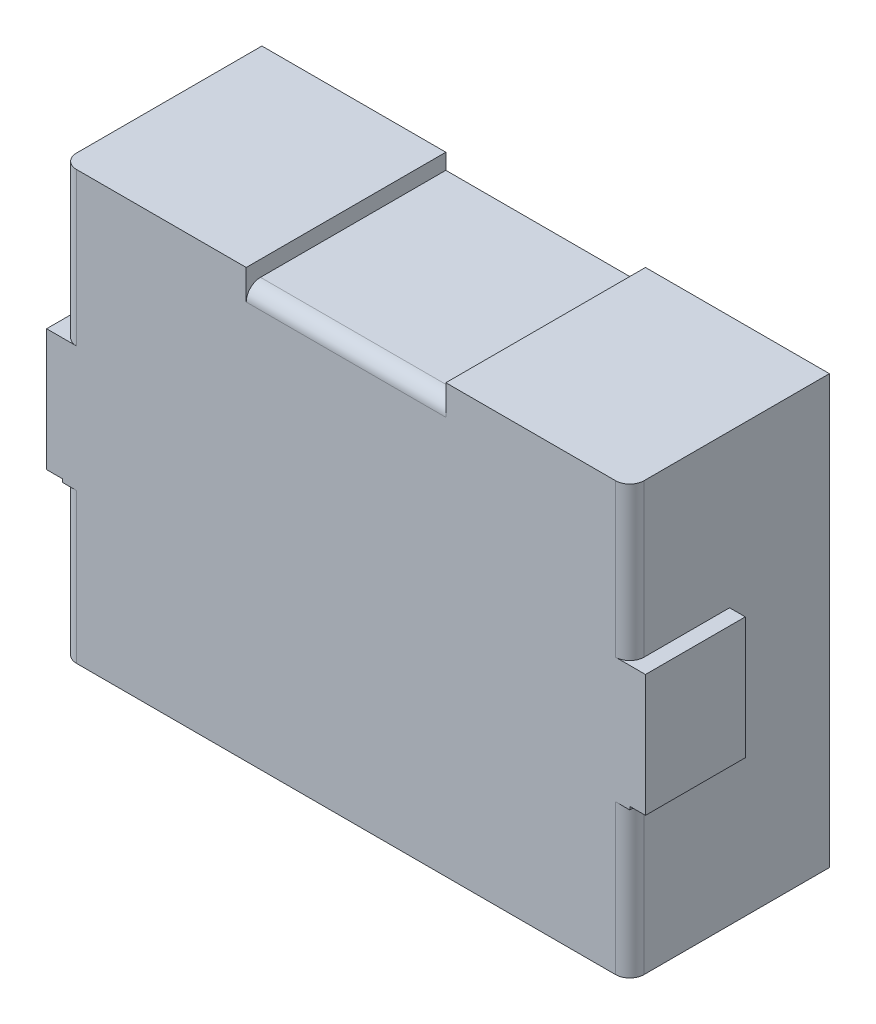
ISO-10303-21;
HEADER;
FILE_DESCRIPTION(('STEP AP214'),'2;1');
FILE_NAME('part.step','',(''),(''),'','','');
FILE_SCHEMA(('AUTOMOTIVE_DESIGN { 1 0 10303 214 1 1 1 1 }'));
ENDSEC;
DATA;
#1=APPLICATION_CONTEXT('core data for automotive mechanical design processes');
#2=APPLICATION_PROTOCOL_DEFINITION('international standard','automotive_design',2000,#1);
#3=PRODUCT_CONTEXT('',#1,'mechanical');
#4=PRODUCT('Part','Part','',(#3));
#5=PRODUCT_RELATED_PRODUCT_CATEGORY('part','',(#4));
#6=PRODUCT_DEFINITION_FORMATION('','',#4);
#7=PRODUCT_DEFINITION_CONTEXT('part definition',#1,'design');
#8=PRODUCT_DEFINITION('design','',#6,#7);
#9=PRODUCT_DEFINITION_SHAPE('','',#8);
#10=(LENGTH_UNIT() NAMED_UNIT(*) SI_UNIT(.MILLI.,.METRE.));
#11=(NAMED_UNIT(*) PLANE_ANGLE_UNIT() SI_UNIT($,.RADIAN.));
#12=(NAMED_UNIT(*) SI_UNIT($,.STERADIAN.) SOLID_ANGLE_UNIT());
#13=UNCERTAINTY_MEASURE_WITH_UNIT(LENGTH_MEASURE(1.E-05),#10,'distance_accuracy_value','');
#14=(GEOMETRIC_REPRESENTATION_CONTEXT(3) GLOBAL_UNCERTAINTY_ASSIGNED_CONTEXT((#13)) GLOBAL_UNIT_ASSIGNED_CONTEXT((#10,
#11,#12)) REPRESENTATION_CONTEXT('',''));
#15=CARTESIAN_POINT('',(0.,0.,0.));
#16=DIRECTION('',(0.,0.,1.));
#17=DIRECTION('',(1.,0.,0.));
#18=AXIS2_PLACEMENT_3D('',#15,#16,#17);
#19=CARTESIAN_POINT('',(2.1,0.,1.4));
#20=DIRECTION('',(1.,0.,0.));
#21=DIRECTION('',(0.,0.,-1.));
#22=AXIS2_PLACEMENT_3D('',#19,#20,#21);
#23=PLANE('',#22);
#24=DIRECTION('',(0.,1.,0.));
#25=VECTOR('',#24,1.);
#26=CARTESIAN_POINT('',(2.1,0.,0.7));
#27=LINE('',#26,#25);
#28=CARTESIAN_POINT('',(2.1,0.427884559631,0.7));
#29=VERTEX_POINT('',#28);
#30=CARTESIAN_POINT('',(2.1,-0.427884559631,0.7));
#31=VERTEX_POINT('',#30);
#32=EDGE_CURVE('E270',#29,#31,#27,.F.);
#33=ORIENTED_EDGE('',*,*,#32,.F.);
#34=DIRECTION('',(0.,0.,1.));
#35=VECTOR('',#34,1.);
#36=CARTESIAN_POINT('',(2.1,0.427884559631,1.05));
#37=LINE('',#36,#35);
#38=CARTESIAN_POINT('',(2.1,0.427884559631,1.4));
#39=VERTEX_POINT('',#38);
#40=EDGE_CURVE('E210',#39,#29,#37,.F.);
#41=ORIENTED_EDGE('',*,*,#40,.F.);
#42=DIRECTION('',(0.,1.,0.));
#43=VECTOR('',#42,1.);
#44=CARTESIAN_POINT('',(2.1,0.00558828281121,1.4));
#45=LINE('',#44,#43);
#46=CARTESIAN_POINT('',(2.1,-0.427884559631,1.4));
#47=VERTEX_POINT('',#46);
#48=EDGE_CURVE('E256',#47,#39,#45,.T.);
#49=ORIENTED_EDGE('',*,*,#48,.F.);
#50=DIRECTION('',(0.,0.,-1.));
#51=VECTOR('',#50,1.);
#52=CARTESIAN_POINT('',(2.1,-0.427884559631,1.05));
#53=LINE('',#52,#51);
#54=EDGE_CURVE('E282',#31,#47,#53,.F.);
#55=ORIENTED_EDGE('',*,*,#54,.F.);
#56=EDGE_LOOP('',(#33,#41,#49,#55));
#57=FACE_BOUND('',#56,.T.);
#58=ADVANCED_FACE('F17',(#57),#23,.T.);
#59=CARTESIAN_POINT('',(-2.1,0.,1.4));
#60=DIRECTION('',(1.,0.,0.));
#61=DIRECTION('',(0.,0.,-1.));
#62=AXIS2_PLACEMENT_3D('',#59,#60,#61);
#63=PLANE('',#62);
#64=DIRECTION('',(0.,1.,0.));
#65=VECTOR('',#64,1.);
#66=CARTESIAN_POINT('',(-2.1,0.00558828281121,1.4));
#67=LINE('',#66,#65);
#68=CARTESIAN_POINT('',(-2.1,0.427884559631,1.4));
#69=VERTEX_POINT('',#68);
#70=CARTESIAN_POINT('',(-2.1,-0.427884559631,1.4));
#71=VERTEX_POINT('',#70);
#72=EDGE_CURVE('E213',#69,#71,#67,.F.);
#73=ORIENTED_EDGE('',*,*,#72,.F.);
#74=DIRECTION('',(0.,0.,1.));
#75=VECTOR('',#74,1.);
#76=CARTESIAN_POINT('',(-2.1,0.427884559631,1.05));
#77=LINE('',#76,#75);
#78=CARTESIAN_POINT('',(-2.1,0.427884559631,0.7));
#79=VERTEX_POINT('',#78);
#80=EDGE_CURVE('E216',#79,#69,#77,.T.);
#81=ORIENTED_EDGE('',*,*,#80,.F.);
#82=DIRECTION('',(0.,1.,0.));
#83=VECTOR('',#82,1.);
#84=CARTESIAN_POINT('',(-2.1,0.,0.7));
#85=LINE('',#84,#83);
#86=CARTESIAN_POINT('',(-2.1,-0.427884559631,0.7));
#87=VERTEX_POINT('',#86);
#88=EDGE_CURVE('E219',#87,#79,#85,.T.);
#89=ORIENTED_EDGE('',*,*,#88,.F.);
#90=DIRECTION('',(0.,0.,-1.));
#91=VECTOR('',#90,1.);
#92=CARTESIAN_POINT('',(-2.1,-0.427884559631,1.05));
#93=LINE('',#92,#91);
#94=EDGE_CURVE('E227',#71,#87,#93,.T.);
#95=ORIENTED_EDGE('',*,*,#94,.F.);
#96=EDGE_LOOP('',(#73,#81,#89,#95));
#97=FACE_BOUND('',#96,.T.);
#98=ADVANCED_FACE('F475',(#97),#63,.F.);
#99=CARTESIAN_POINT('',(-8.062845587312,0.00558828281121,1.4));
#100=DIRECTION('',(0.,0.,1.));
#101=DIRECTION('',(1.,0.,0.));
#102=AXIS2_PLACEMENT_3D('',#99,#100,#101);
#103=PLANE('',#102);
#104=DIRECTION('',(0.,-1.,0.));
#105=VECTOR('',#104,1.);
#106=CARTESIAN_POINT('',(1.89,0.45,1.4));
#107=LINE('',#106,#105);
#108=CARTESIAN_POINT('',(1.89,1.5,1.4));
#109=VERTEX_POINT('',#108);
#110=CARTESIAN_POINT('',(1.89,0.427884559631,1.4));
#111=VERTEX_POINT('',#110);
#112=EDGE_CURVE('E321',#109,#111,#107,.T.);
#113=ORIENTED_EDGE('',*,*,#112,.F.);
#114=DIRECTION('',(1.,0.,0.));
#115=VECTOR('',#114,1.);
#116=CARTESIAN_POINT('',(-8.062845587312,1.5,1.4));
#117=LINE('',#116,#115);
#118=CARTESIAN_POINT('',(0.7,1.5,1.4));
#119=VERTEX_POINT('',#118);
#120=EDGE_CURVE('E202',#109,#119,#117,.F.);
#121=ORIENTED_EDGE('',*,*,#120,.T.);
#122=DIRECTION('',(0.,1.,0.));
#123=VECTOR('',#122,1.);
#124=CARTESIAN_POINT('',(0.7,1.5,1.4));
#125=LINE('',#124,#123);
#126=CARTESIAN_POINT('',(0.7,1.29,1.4));
#127=VERTEX_POINT('',#126);
#128=EDGE_CURVE('E254',#127,#119,#125,.T.);
#129=ORIENTED_EDGE('',*,*,#128,.F.);
#130=DIRECTION('',(1.,0.,0.));
#131=VECTOR('',#130,1.);
#132=CARTESIAN_POINT('',(0.49,1.29,1.4));
#133=LINE('',#132,#131);
#134=CARTESIAN_POINT('',(-0.7,1.29,1.4));
#135=VERTEX_POINT('',#134);
#136=EDGE_CURVE('E251',#135,#127,#133,.T.);
#137=ORIENTED_EDGE('',*,*,#136,.F.);
#138=DIRECTION('',(0.,1.,0.));
#139=VECTOR('',#138,1.);
#140=CARTESIAN_POINT('',(-0.7,1.5,1.4));
#141=LINE('',#140,#139);
#142=CARTESIAN_POINT('',(-0.7,1.5,1.4));
#143=VERTEX_POINT('',#142);
#144=EDGE_CURVE('E320',#135,#143,#141,.T.);
#145=ORIENTED_EDGE('',*,*,#144,.T.);
#146=DIRECTION('',(1.,0.,0.));
#147=VECTOR('',#146,1.);
#148=CARTESIAN_POINT('',(-8.062845587312,1.5,1.4));
#149=LINE('',#148,#147);
#150=CARTESIAN_POINT('',(-1.89,1.5,1.4));
#151=VERTEX_POINT('',#150);
#152=EDGE_CURVE('E238',#143,#151,#149,.F.);
#153=ORIENTED_EDGE('',*,*,#152,.T.);
#154=DIRECTION('',(0.,1.,0.));
#155=VECTOR('',#154,1.);
#156=CARTESIAN_POINT('',(-1.89,0.45,1.4));
#157=LINE('',#156,#155);
#158=CARTESIAN_POINT('',(-1.89,0.427884559631,1.4));
#159=VERTEX_POINT('',#158);
#160=EDGE_CURVE('E410',#159,#151,#157,.T.);
#161=ORIENTED_EDGE('',*,*,#160,.F.);
#162=DIRECTION('',(1.,0.,0.));
#163=VECTOR('',#162,1.);
#164=CARTESIAN_POINT('',(-2.1,0.427884559631,1.4));
#165=LINE('',#164,#163);
#166=EDGE_CURVE('E316',#69,#159,#165,.T.);
#167=ORIENTED_EDGE('',*,*,#166,.F.);
#168=ORIENTED_EDGE('',*,*,#72,.T.);
#169=DIRECTION('',(1.,0.,0.));
#170=VECTOR('',#169,1.);
#171=CARTESIAN_POINT('',(-2.1,-0.427884559631,1.4));
#172=LINE('',#171,#170);
#173=CARTESIAN_POINT('',(-1.99,-0.427884559631,1.4));
#174=VERTEX_POINT('',#173);
#175=EDGE_CURVE('E230',#174,#71,#172,.F.);
#176=ORIENTED_EDGE('',*,*,#175,.F.);
#177=DIRECTION('',(0.,1.,0.));
#178=VECTOR('',#177,1.);
#179=CARTESIAN_POINT('',(-1.99,0.00558828281121,1.4));
#180=LINE('',#179,#178);
#181=CARTESIAN_POINT('',(-1.99,-0.45,1.4));
#182=VERTEX_POINT('',#181);
#183=EDGE_CURVE('E211',#174,#182,#180,.F.);
#184=ORIENTED_EDGE('',*,*,#183,.T.);
#185=DIRECTION('',(1.,0.,0.));
#186=VECTOR('',#185,1.);
#187=CARTESIAN_POINT('',(-1.84,-0.45,1.4));
#188=LINE('',#187,#186);
#189=CARTESIAN_POINT('',(-1.89,-0.45,1.4));
#190=VERTEX_POINT('',#189);
#191=EDGE_CURVE('E208',#190,#182,#188,.F.);
#192=ORIENTED_EDGE('',*,*,#191,.F.);
#193=DIRECTION('',(0.,1.,0.));
#194=VECTOR('',#193,1.);
#195=CARTESIAN_POINT('',(-1.89,-1.5,1.4));
#196=LINE('',#195,#194);
#197=CARTESIAN_POINT('',(-1.89,-1.5,1.4));
#198=VERTEX_POINT('',#197);
#199=EDGE_CURVE('E205',#198,#190,#196,.T.);
#200=ORIENTED_EDGE('',*,*,#199,.F.);
#201=DIRECTION('',(1.,0.,0.));
#202=VECTOR('',#201,1.);
#203=CARTESIAN_POINT('',(0.,-1.5,1.4));
#204=LINE('',#203,#202);
#205=CARTESIAN_POINT('',(1.89,-1.5,1.4));
#206=VERTEX_POINT('',#205);
#207=EDGE_CURVE('E312',#206,#198,#204,.F.);
#208=ORIENTED_EDGE('',*,*,#207,.F.);
#209=DIRECTION('',(0.,-1.,0.));
#210=VECTOR('',#209,1.);
#211=CARTESIAN_POINT('',(1.89,-1.5,1.4));
#212=LINE('',#211,#210);
#213=CARTESIAN_POINT('',(1.89,-0.45,1.4));
#214=VERTEX_POINT('',#213);
#215=EDGE_CURVE('E184',#214,#206,#212,.T.);
#216=ORIENTED_EDGE('',*,*,#215,.F.);
#217=DIRECTION('',(1.,0.,0.));
#218=VECTOR('',#217,1.);
#219=CARTESIAN_POINT('',(1.84,-0.45,1.4));
#220=LINE('',#219,#218);
#221=CARTESIAN_POINT('',(1.99,-0.45,1.4));
#222=VERTEX_POINT('',#221);
#223=EDGE_CURVE('E181',#214,#222,#220,.T.);
#224=ORIENTED_EDGE('',*,*,#223,.T.);
#225=DIRECTION('',(0.,1.,0.));
#226=VECTOR('',#225,1.);
#227=CARTESIAN_POINT('',(1.99,0.00558828281121,1.4));
#228=LINE('',#227,#226);
#229=CARTESIAN_POINT('',(1.99,-0.427884559631,1.4));
#230=VERTEX_POINT('',#229);
#231=EDGE_CURVE('E173',#222,#230,#228,.T.);
#232=ORIENTED_EDGE('',*,*,#231,.T.);
#233=DIRECTION('',(1.,0.,0.));
#234=VECTOR('',#233,1.);
#235=CARTESIAN_POINT('',(2.1,-0.427884559631,1.4));
#236=LINE('',#235,#234);
#237=EDGE_CURVE('E284',#47,#230,#236,.F.);
#238=ORIENTED_EDGE('',*,*,#237,.F.);
#239=ORIENTED_EDGE('',*,*,#48,.T.);
#240=DIRECTION('',(1.,0.,0.));
#241=VECTOR('',#240,1.);
#242=CARTESIAN_POINT('',(2.1,0.427884559631,1.4));
#243=LINE('',#242,#241);
#244=EDGE_CURVE('E267',#111,#39,#243,.T.);
#245=ORIENTED_EDGE('',*,*,#244,.F.);
#246=EDGE_LOOP('',(#113,#121,#129,#137,#145,#153,#161,#167,#168,#176,#184,#192,#200,#208,#216,
#224,#232,#238,#239,#245));
#247=FACE_BOUND('',#246,.T.);
#248=ADVANCED_FACE('F364',(#247),#103,.T.);
#249=CARTESIAN_POINT('',(1.84,-0.45,1.4));
#250=DIRECTION('',(0.,1.,0.));
#251=DIRECTION('',(0.,0.,1.));
#252=AXIS2_PLACEMENT_3D('',#249,#250,#251);
#253=PLANE('',#252);
#254=CARTESIAN_POINT('',(1.89,-0.45,1.3));
#255=DIRECTION('',(0.,-1.,0.));
#256=DIRECTION('',(0.,0.,-1.));
#257=AXIS2_PLACEMENT_3D('',#254,#255,#256);
#258=CIRCLE('',#257,0.1);
#259=CARTESIAN_POINT('',(1.99,-0.45,1.3));
#260=VERTEX_POINT('',#259);
#261=EDGE_CURVE('E20',#260,#214,#258,.T.);
#262=ORIENTED_EDGE('',*,*,#261,.F.);
#263=DIRECTION('',(0.,0.,-1.));
#264=VECTOR('',#263,1.);
#265=CARTESIAN_POINT('',(1.99,-0.45,1.4));
#266=LINE('',#265,#264);
#267=EDGE_CURVE('E166',#222,#260,#266,.T.);
#268=ORIENTED_EDGE('',*,*,#267,.F.);
#269=ORIENTED_EDGE('',*,*,#223,.F.);
#270=EDGE_LOOP('',(#262,#268,#269));
#271=FACE_BOUND('',#270,.T.);
#272=ADVANCED_FACE('F180',(#271),#253,.F.);
#273=CARTESIAN_POINT('',(1.89,-1.5,1.3));
#274=DIRECTION('',(0.,-1.,0.));
#275=DIRECTION('',(0.,0.,-1.));
#276=AXIS2_PLACEMENT_3D('',#273,#274,#275);
#277=CYLINDRICAL_SURFACE('',#276,0.1);
#278=ORIENTED_EDGE('',*,*,#261,.T.);
#279=ORIENTED_EDGE('',*,*,#215,.T.);
#280=CARTESIAN_POINT('',(1.89,-1.5,1.3));
#281=DIRECTION('',(0.,-1.,0.));
#282=DIRECTION('',(0.,0.,-1.));
#283=AXIS2_PLACEMENT_3D('',#280,#281,#282);
#284=CIRCLE('',#283,0.1);
#285=CARTESIAN_POINT('',(1.99,-1.5,1.3));
#286=VERTEX_POINT('',#285);
#287=EDGE_CURVE('E187',#286,#206,#284,.T.);
#288=ORIENTED_EDGE('',*,*,#287,.F.);
#289=DIRECTION('',(0.,1.,0.));
#290=VECTOR('',#289,1.);
#291=CARTESIAN_POINT('',(1.99,0.,1.3));
#292=LINE('',#291,#290);
#293=EDGE_CURVE('E171',#260,#286,#292,.F.);
#294=ORIENTED_EDGE('',*,*,#293,.F.);
#295=EDGE_LOOP('',(#278,#279,#288,#294));
#296=FACE_BOUND('',#295,.T.);
#297=ADVANCED_FACE('F185',(#296),#277,.T.);
#298=CARTESIAN_POINT('',(2.1,0.427884559631,1.05));
#299=DIRECTION('',(0.,1.,0.));
#300=DIRECTION('',(0.,0.,1.));
#301=AXIS2_PLACEMENT_3D('',#298,#299,#300);
#302=PLANE('',#301);
#303=CARTESIAN_POINT('',(1.89,0.427884559631,1.3));
#304=DIRECTION('',(0.,-1.,0.));
#305=DIRECTION('',(0.,0.,-1.));
#306=AXIS2_PLACEMENT_3D('',#303,#304,#305);
#307=CIRCLE('',#306,0.1);
#308=CARTESIAN_POINT('',(1.99,0.427884559631,1.3));
#309=VERTEX_POINT('',#308);
#310=EDGE_CURVE('E289',#111,#309,#307,.F.);
#311=ORIENTED_EDGE('',*,*,#310,.F.);
#312=ORIENTED_EDGE('',*,*,#244,.T.);
#313=ORIENTED_EDGE('',*,*,#40,.T.);
#314=DIRECTION('',(-1.,0.,0.));
#315=VECTOR('',#314,1.);
#316=CARTESIAN_POINT('',(2.1,0.427884559631,0.7));
#317=LINE('',#316,#315);
#318=CARTESIAN_POINT('',(1.99,0.427884559631,0.7));
#319=VERTEX_POINT('',#318);
#320=EDGE_CURVE('E273',#319,#29,#317,.F.);
#321=ORIENTED_EDGE('',*,*,#320,.F.);
#322=DIRECTION('',(0.,0.,-1.));
#323=VECTOR('',#322,1.);
#324=CARTESIAN_POINT('',(1.99,0.427884559631,1.4));
#325=LINE('',#324,#323);
#326=EDGE_CURVE('E342',#309,#319,#325,.T.);
#327=ORIENTED_EDGE('',*,*,#326,.F.);
#328=EDGE_LOOP('',(#311,#312,#313,#321,#327));
#329=FACE_BOUND('',#328,.T.);
#330=ADVANCED_FACE('F471',(#329),#302,.T.);
#331=CARTESIAN_POINT('',(2.1,0.,0.7));
#332=DIRECTION('',(0.,0.,-1.));
#333=DIRECTION('',(-1.,0.,0.));
#334=AXIS2_PLACEMENT_3D('',#331,#332,#333);
#335=PLANE('',#334);
#336=ORIENTED_EDGE('',*,*,#32,.T.);
#337=DIRECTION('',(1.,0.,0.));
#338=VECTOR('',#337,1.);
#339=CARTESIAN_POINT('',(2.1,-0.427884559631,0.7));
#340=LINE('',#339,#338);
#341=CARTESIAN_POINT('',(1.99,-0.427884559631,0.7));
#342=VERTEX_POINT('',#341);
#343=EDGE_CURVE('E272',#342,#31,#340,.T.);
#344=ORIENTED_EDGE('',*,*,#343,.F.);
#345=DIRECTION('',(0.,1.,0.));
#346=VECTOR('',#345,1.);
#347=CARTESIAN_POINT('',(1.99,0.,0.7));
#348=LINE('',#347,#346);
#349=EDGE_CURVE('E293',#319,#342,#348,.F.);
#350=ORIENTED_EDGE('',*,*,#349,.F.);
#351=ORIENTED_EDGE('',*,*,#320,.T.);
#352=EDGE_LOOP('',(#336,#344,#350,#351));
#353=FACE_BOUND('',#352,.T.);
#354=ADVANCED_FACE('F356',(#353),#335,.T.);
#355=CARTESIAN_POINT('',(2.1,-0.427884559631,1.05));
#356=DIRECTION('',(0.,-1.,0.));
#357=DIRECTION('',(0.,0.,-1.));
#358=AXIS2_PLACEMENT_3D('',#355,#356,#357);
#359=PLANE('',#358);
#360=ORIENTED_EDGE('',*,*,#54,.T.);
#361=ORIENTED_EDGE('',*,*,#237,.T.);
#362=DIRECTION('',(0.,0.,-1.));
#363=VECTOR('',#362,1.);
#364=CARTESIAN_POINT('',(1.99,-0.427884559631,1.4));
#365=LINE('',#364,#363);
#366=EDGE_CURVE('E263',#342,#230,#365,.F.);
#367=ORIENTED_EDGE('',*,*,#366,.F.);
#368=ORIENTED_EDGE('',*,*,#343,.T.);
#369=EDGE_LOOP('',(#360,#361,#367,#368));
#370=FACE_BOUND('',#369,.T.);
#371=ADVANCED_FACE('F360',(#370),#359,.T.);
#372=CARTESIAN_POINT('',(1.89,0.45,1.3));
#373=DIRECTION('',(0.,-1.,0.));
#374=DIRECTION('',(0.,0.,-1.));
#375=AXIS2_PLACEMENT_3D('',#372,#373,#374);
#376=CYLINDRICAL_SURFACE('',#375,0.1);
#377=CARTESIAN_POINT('',(1.89,1.5,1.3));
#378=DIRECTION('',(0.,-1.,0.));
#379=DIRECTION('',(0.,0.,-1.));
#380=AXIS2_PLACEMENT_3D('',#377,#378,#379);
#381=CIRCLE('',#380,0.1);
#382=CARTESIAN_POINT('',(1.99,1.5,1.3));
#383=VERTEX_POINT('',#382);
#384=EDGE_CURVE('E262',#109,#383,#381,.F.);
#385=ORIENTED_EDGE('',*,*,#384,.F.);
#386=ORIENTED_EDGE('',*,*,#112,.T.);
#387=ORIENTED_EDGE('',*,*,#310,.T.);
#388=DIRECTION('',(0.,1.,0.));
#389=VECTOR('',#388,1.);
#390=CARTESIAN_POINT('',(1.99,0.,1.3));
#391=LINE('',#390,#389);
#392=EDGE_CURVE('E191',#383,#309,#391,.F.);
#393=ORIENTED_EDGE('',*,*,#392,.F.);
#394=EDGE_LOOP('',(#385,#386,#387,#393));
#395=FACE_BOUND('',#394,.T.);
#396=ADVANCED_FACE('F538',(#395),#376,.T.);
#397=CARTESIAN_POINT('',(0.7,1.5,0.7));
#398=DIRECTION('',(-1.,0.,0.));
#399=DIRECTION('',(0.,0.,1.));
#400=AXIS2_PLACEMENT_3D('',#397,#398,#399);
#401=PLANE('',#400);
#402=CARTESIAN_POINT('',(0.7,1.29,1.3));
#403=DIRECTION('',(1.,0.,0.));
#404=DIRECTION('',(0.,0.,-1.));
#405=AXIS2_PLACEMENT_3D('',#402,#403,#404);
#406=CIRCLE('',#405,0.1);
#407=CARTESIAN_POINT('',(0.7,1.39,1.3));
#408=VERTEX_POINT('',#407);
#409=EDGE_CURVE('E253',#127,#408,#406,.F.);
#410=ORIENTED_EDGE('',*,*,#409,.F.);
#411=ORIENTED_EDGE('',*,*,#128,.T.);
#412=DIRECTION('',(0.,0.,1.));
#413=VECTOR('',#412,1.);
#414=CARTESIAN_POINT('',(0.7,1.5,1.4));
#415=LINE('',#414,#413);
#416=CARTESIAN_POINT('',(0.7,1.5,0.));
#417=VERTEX_POINT('',#416);
#418=EDGE_CURVE('E259',#417,#119,#415,.T.);
#419=ORIENTED_EDGE('',*,*,#418,.F.);
#420=DIRECTION('',(0.,1.,0.));
#421=VECTOR('',#420,1.);
#422=CARTESIAN_POINT('',(0.7,1.5,0.));
#423=LINE('',#422,#421);
#424=CARTESIAN_POINT('',(0.7,1.39,0.));
#425=VERTEX_POINT('',#424);
#426=EDGE_CURVE('E327',#417,#425,#423,.F.);
#427=ORIENTED_EDGE('',*,*,#426,.T.);
#428=DIRECTION('',(0.,0.,1.));
#429=VECTOR('',#428,1.);
#430=CARTESIAN_POINT('',(0.7,1.39,1.4));
#431=LINE('',#430,#429);
#432=EDGE_CURVE('E394',#408,#425,#431,.F.);
#433=ORIENTED_EDGE('',*,*,#432,.F.);
#434=EDGE_LOOP('',(#410,#411,#419,#427,#433));
#435=FACE_BOUND('',#434,.T.);
#436=ADVANCED_FACE('F534',(#435),#401,.T.);
#437=CARTESIAN_POINT('',(0.49,1.29,1.3));
#438=DIRECTION('',(1.,0.,0.));
#439=DIRECTION('',(0.,0.,-1.));
#440=AXIS2_PLACEMENT_3D('',#437,#438,#439);
#441=CYLINDRICAL_SURFACE('',#440,0.1);
#442=DIRECTION('',(1.,0.,0.));
#443=VECTOR('',#442,1.);
#444=CARTESIAN_POINT('',(0.,1.39,1.3));
#445=LINE('',#444,#443);
#446=CARTESIAN_POINT('',(-0.7,1.39,1.3));
#447=VERTEX_POINT('',#446);
#448=EDGE_CURVE('E308',#447,#408,#445,.T.);
#449=ORIENTED_EDGE('',*,*,#448,.F.);
#450=CARTESIAN_POINT('',(-0.7,1.29,1.3));
#451=DIRECTION('',(1.,0.,0.));
#452=DIRECTION('',(0.,0.,-1.));
#453=AXIS2_PLACEMENT_3D('',#450,#451,#452);
#454=CIRCLE('',#453,0.1);
#455=EDGE_CURVE('E317',#447,#135,#454,.T.);
#456=ORIENTED_EDGE('',*,*,#455,.T.);
#457=ORIENTED_EDGE('',*,*,#136,.T.);
#458=ORIENTED_EDGE('',*,*,#409,.T.);
#459=EDGE_LOOP('',(#449,#456,#457,#458));
#460=FACE_BOUND('',#459,.T.);
#461=ADVANCED_FACE('F530',(#460),#441,.T.);
#462=CARTESIAN_POINT('',(-0.7,1.5,0.7));
#463=DIRECTION('',(-1.,0.,0.));
#464=DIRECTION('',(0.,0.,1.));
#465=AXIS2_PLACEMENT_3D('',#462,#463,#464);
#466=PLANE('',#465);
#467=DIRECTION('',(0.,0.,-1.));
#468=VECTOR('',#467,1.);
#469=CARTESIAN_POINT('',(-0.7,1.5,1.4));
#470=LINE('',#469,#468);
#471=CARTESIAN_POINT('',(-0.7,1.5,0.));
#472=VERTEX_POINT('',#471);
#473=EDGE_CURVE('E244',#472,#143,#470,.F.);
#474=ORIENTED_EDGE('',*,*,#473,.T.);
#475=ORIENTED_EDGE('',*,*,#144,.F.);
#476=ORIENTED_EDGE('',*,*,#455,.F.);
#477=DIRECTION('',(0.,0.,1.));
#478=VECTOR('',#477,1.);
#479=CARTESIAN_POINT('',(-0.7,1.39,1.4));
#480=LINE('',#479,#478);
#481=CARTESIAN_POINT('',(-0.7,1.39,0.));
#482=VERTEX_POINT('',#481);
#483=EDGE_CURVE('E397',#482,#447,#480,.T.);
#484=ORIENTED_EDGE('',*,*,#483,.F.);
#485=DIRECTION('',(0.,1.,0.));
#486=VECTOR('',#485,1.);
#487=CARTESIAN_POINT('',(-0.7,1.5,0.));
#488=LINE('',#487,#486);
#489=EDGE_CURVE('E408',#472,#482,#488,.F.);
#490=ORIENTED_EDGE('',*,*,#489,.F.);
#491=EDGE_LOOP('',(#474,#475,#476,#484,#490));
#492=FACE_BOUND('',#491,.T.);
#493=ADVANCED_FACE('F526',(#492),#466,.F.);
#494=CARTESIAN_POINT('',(-1.89,0.45,1.3));
#495=DIRECTION('',(0.,1.,0.));
#496=DIRECTION('',(0.,0.,1.));
#497=AXIS2_PLACEMENT_3D('',#494,#495,#496);
#498=CYLINDRICAL_SURFACE('',#497,0.1);
#499=CARTESIAN_POINT('',(-1.89,1.5,1.3));
#500=DIRECTION('',(0.,1.,0.));
#501=DIRECTION('',(0.,0.,1.));
#502=AXIS2_PLACEMENT_3D('',#499,#500,#501);
#503=CIRCLE('',#502,0.1);
#504=CARTESIAN_POINT('',(-1.99,1.5,1.3));
#505=VERTEX_POINT('',#504);
#506=EDGE_CURVE('E248',#151,#505,#503,.F.);
#507=ORIENTED_EDGE('',*,*,#506,.T.);
#508=DIRECTION('',(0.,1.,0.));
#509=VECTOR('',#508,1.);
#510=CARTESIAN_POINT('',(-1.99,0.,1.3));
#511=LINE('',#510,#509);
#512=CARTESIAN_POINT('',(-1.99,0.427884559631,1.3));
#513=VERTEX_POINT('',#512);
#514=EDGE_CURVE('E437',#505,#513,#511,.F.);
#515=ORIENTED_EDGE('',*,*,#514,.T.);
#516=CARTESIAN_POINT('',(-1.89,0.427884559631,1.3));
#517=DIRECTION('',(0.,1.,0.));
#518=DIRECTION('',(0.,0.,1.));
#519=AXIS2_PLACEMENT_3D('',#516,#517,#518);
#520=CIRCLE('',#519,0.1);
#521=EDGE_CURVE('E220',#159,#513,#520,.F.);
#522=ORIENTED_EDGE('',*,*,#521,.F.);
#523=ORIENTED_EDGE('',*,*,#160,.T.);
#524=EDGE_LOOP('',(#507,#515,#522,#523));
#525=FACE_BOUND('',#524,.T.);
#526=ADVANCED_FACE('F522',(#525),#498,.T.);
#527=CARTESIAN_POINT('',(-2.1,0.427884559631,1.05));
#528=DIRECTION('',(0.,1.,0.));
#529=DIRECTION('',(0.,0.,1.));
#530=AXIS2_PLACEMENT_3D('',#527,#528,#529);
#531=PLANE('',#530);
#532=DIRECTION('',(-1.,0.,0.));
#533=VECTOR('',#532,1.);
#534=CARTESIAN_POINT('',(-2.1,0.427884559631,0.7));
#535=LINE('',#534,#533);
#536=CARTESIAN_POINT('',(-1.99,0.427884559631,0.7));
#537=VERTEX_POINT('',#536);
#538=EDGE_CURVE('E224',#79,#537,#535,.F.);
#539=ORIENTED_EDGE('',*,*,#538,.F.);
#540=ORIENTED_EDGE('',*,*,#80,.T.);
#541=ORIENTED_EDGE('',*,*,#166,.T.);
#542=ORIENTED_EDGE('',*,*,#521,.T.);
#543=DIRECTION('',(0.,0.,-1.));
#544=VECTOR('',#543,1.);
#545=CARTESIAN_POINT('',(-1.99,0.427884559631,1.4));
#546=LINE('',#545,#544);
#547=EDGE_CURVE('E445',#513,#537,#546,.T.);
#548=ORIENTED_EDGE('',*,*,#547,.T.);
#549=EDGE_LOOP('',(#539,#540,#541,#542,#548));
#550=FACE_BOUND('',#549,.T.);
#551=ADVANCED_FACE('F518',(#550),#531,.T.);
#552=CARTESIAN_POINT('',(-2.1,0.,0.7));
#553=DIRECTION('',(0.,0.,-1.));
#554=DIRECTION('',(-1.,0.,0.));
#555=AXIS2_PLACEMENT_3D('',#552,#553,#554);
#556=PLANE('',#555);
#557=ORIENTED_EDGE('',*,*,#88,.T.);
#558=ORIENTED_EDGE('',*,*,#538,.T.);
#559=DIRECTION('',(0.,1.,0.));
#560=VECTOR('',#559,1.);
#561=CARTESIAN_POINT('',(-1.99,0.,0.7));
#562=LINE('',#561,#560);
#563=CARTESIAN_POINT('',(-1.99,-0.427884559631,0.7));
#564=VERTEX_POINT('',#563);
#565=EDGE_CURVE('E304',#537,#564,#562,.F.);
#566=ORIENTED_EDGE('',*,*,#565,.T.);
#567=DIRECTION('',(1.,0.,0.));
#568=VECTOR('',#567,1.);
#569=CARTESIAN_POINT('',(-2.1,-0.427884559631,0.7));
#570=LINE('',#569,#568);
#571=EDGE_CURVE('E229',#87,#564,#570,.T.);
#572=ORIENTED_EDGE('',*,*,#571,.F.);
#573=EDGE_LOOP('',(#557,#558,#566,#572));
#574=FACE_BOUND('',#573,.T.);
#575=ADVANCED_FACE('F514',(#574),#556,.T.);
#576=CARTESIAN_POINT('',(-2.1,-0.427884559631,1.05));
#577=DIRECTION('',(0.,-1.,0.));
#578=DIRECTION('',(0.,0.,-1.));
#579=AXIS2_PLACEMENT_3D('',#576,#577,#578);
#580=PLANE('',#579);
#581=ORIENTED_EDGE('',*,*,#94,.T.);
#582=ORIENTED_EDGE('',*,*,#571,.T.);
#583=DIRECTION('',(0.,0.,-1.));
#584=VECTOR('',#583,1.);
#585=CARTESIAN_POINT('',(-1.99,-0.427884559631,1.4));
#586=LINE('',#585,#584);
#587=EDGE_CURVE('E300',#564,#174,#586,.F.);
#588=ORIENTED_EDGE('',*,*,#587,.T.);
#589=ORIENTED_EDGE('',*,*,#175,.T.);
#590=EDGE_LOOP('',(#581,#582,#588,#589));
#591=FACE_BOUND('',#590,.T.);
#592=ADVANCED_FACE('F510',(#591),#580,.T.);
#593=CARTESIAN_POINT('',(-1.84,-0.45,1.4));
#594=DIRECTION('',(0.,-1.,0.));
#595=DIRECTION('',(0.,0.,-1.));
#596=AXIS2_PLACEMENT_3D('',#593,#594,#595);
#597=PLANE('',#596);
#598=ORIENTED_EDGE('',*,*,#191,.T.);
#599=DIRECTION('',(0.,0.,-1.));
#600=VECTOR('',#599,1.);
#601=CARTESIAN_POINT('',(-1.99,-0.45,1.4));
#602=LINE('',#601,#600);
#603=CARTESIAN_POINT('',(-1.99,-0.45,1.3));
#604=VERTEX_POINT('',#603);
#605=EDGE_CURVE('E303',#182,#604,#602,.T.);
#606=ORIENTED_EDGE('',*,*,#605,.T.);
#607=CARTESIAN_POINT('',(-1.89,-0.45,1.3));
#608=DIRECTION('',(0.,1.,0.));
#609=DIRECTION('',(0.,0.,1.));
#610=AXIS2_PLACEMENT_3D('',#607,#608,#609);
#611=CIRCLE('',#610,0.1);
#612=EDGE_CURVE('E207',#190,#604,#611,.F.);
#613=ORIENTED_EDGE('',*,*,#612,.F.);
#614=EDGE_LOOP('',(#598,#606,#613));
#615=FACE_BOUND('',#614,.T.);
#616=ADVANCED_FACE('F506',(#615),#597,.T.);
#617=CARTESIAN_POINT('',(-1.89,-1.5,1.3));
#618=DIRECTION('',(0.,1.,0.));
#619=DIRECTION('',(0.,0.,1.));
#620=AXIS2_PLACEMENT_3D('',#617,#618,#619);
#621=CYLINDRICAL_SURFACE('',#620,0.1);
#622=ORIENTED_EDGE('',*,*,#612,.T.);
#623=DIRECTION('',(0.,1.,0.));
#624=VECTOR('',#623,1.);
#625=CARTESIAN_POINT('',(-1.99,0.,1.3));
#626=LINE('',#625,#624);
#627=CARTESIAN_POINT('',(-1.99,-1.5,1.3));
#628=VERTEX_POINT('',#627);
#629=EDGE_CURVE('E384',#604,#628,#626,.F.);
#630=ORIENTED_EDGE('',*,*,#629,.T.);
#631=CARTESIAN_POINT('',(-1.89,-1.5,1.3));
#632=DIRECTION('',(0.,1.,0.));
#633=DIRECTION('',(0.,0.,1.));
#634=AXIS2_PLACEMENT_3D('',#631,#632,#633);
#635=CIRCLE('',#634,0.1);
#636=EDGE_CURVE('E177',#198,#628,#635,.F.);
#637=ORIENTED_EDGE('',*,*,#636,.F.);
#638=ORIENTED_EDGE('',*,*,#199,.T.);
#639=EDGE_LOOP('',(#622,#630,#637,#638));
#640=FACE_BOUND('',#639,.T.);
#641=ADVANCED_FACE('F503',(#640),#621,.T.);
#642=CARTESIAN_POINT('',(0.,-1.5,1.4));
#643=DIRECTION('',(0.,-1.,0.));
#644=DIRECTION('',(0.,0.,-1.));
#645=AXIS2_PLACEMENT_3D('',#642,#643,#644);
#646=PLANE('',#645);
#647=ORIENTED_EDGE('',*,*,#207,.T.);
#648=ORIENTED_EDGE('',*,*,#636,.T.);
#649=DIRECTION('',(0.,0.,-1.));
#650=VECTOR('',#649,1.);
#651=CARTESIAN_POINT('',(-1.99,-1.5,1.4));
#652=LINE('',#651,#650);
#653=CARTESIAN_POINT('',(-1.99,-1.5,0.));
#654=VERTEX_POINT('',#653);
#655=EDGE_CURVE('E247',#628,#654,#652,.T.);
#656=ORIENTED_EDGE('',*,*,#655,.T.);
#657=DIRECTION('',(1.,0.,0.));
#658=VECTOR('',#657,1.);
#659=CARTESIAN_POINT('',(-8.062845587312,-1.5,0.));
#660=LINE('',#659,#658);
#661=CARTESIAN_POINT('',(1.99,-1.5,0.));
#662=VERTEX_POINT('',#661);
#663=EDGE_CURVE('E371',#654,#662,#660,.T.);
#664=ORIENTED_EDGE('',*,*,#663,.T.);
#665=DIRECTION('',(0.,0.,-1.));
#666=VECTOR('',#665,1.);
#667=CARTESIAN_POINT('',(1.99,-1.5,1.4));
#668=LINE('',#667,#666);
#669=EDGE_CURVE('E189',#286,#662,#668,.T.);
#670=ORIENTED_EDGE('',*,*,#669,.F.);
#671=ORIENTED_EDGE('',*,*,#287,.T.);
#672=EDGE_LOOP('',(#647,#648,#656,#664,#670,#671));
#673=FACE_BOUND('',#672,.T.);
#674=ADVANCED_FACE('F368',(#673),#646,.T.);
#675=CARTESIAN_POINT('',(1.99,0.,1.4));
#676=DIRECTION('',(1.,0.,0.));
#677=DIRECTION('',(0.,0.,-1.));
#678=AXIS2_PLACEMENT_3D('',#675,#676,#677);
#679=PLANE('',#678);
#680=ORIENTED_EDGE('',*,*,#366,.T.);
#681=ORIENTED_EDGE('',*,*,#231,.F.);
#682=ORIENTED_EDGE('',*,*,#267,.T.);
#683=ORIENTED_EDGE('',*,*,#293,.T.);
#684=ORIENTED_EDGE('',*,*,#669,.T.);
#685=DIRECTION('',(0.,1.,0.));
#686=VECTOR('',#685,1.);
#687=CARTESIAN_POINT('',(1.99,0.00558828281121,0.));
#688=LINE('',#687,#686);
#689=CARTESIAN_POINT('',(1.99,1.5,0.));
#690=VERTEX_POINT('',#689);
#691=EDGE_CURVE('E375',#662,#690,#688,.T.);
#692=ORIENTED_EDGE('',*,*,#691,.T.);
#693=DIRECTION('',(0.,0.,1.));
#694=VECTOR('',#693,1.);
#695=CARTESIAN_POINT('',(1.99,1.5,1.4));
#696=LINE('',#695,#694);
#697=EDGE_CURVE('E310',#383,#690,#696,.F.);
#698=ORIENTED_EDGE('',*,*,#697,.F.);
#699=ORIENTED_EDGE('',*,*,#392,.T.);
#700=ORIENTED_EDGE('',*,*,#326,.T.);
#701=ORIENTED_EDGE('',*,*,#349,.T.);
#702=EDGE_LOOP('',(#680,#681,#682,#683,#684,#692,#698,#699,#700,#701));
#703=FACE_BOUND('',#702,.T.);
#704=ADVANCED_FACE('F169',(#703),#679,.T.);
#705=CARTESIAN_POINT('',(0.,1.5,1.4));
#706=DIRECTION('',(0.,1.,0.));
#707=DIRECTION('',(0.,0.,1.));
#708=AXIS2_PLACEMENT_3D('',#705,#706,#707);
#709=PLANE('',#708);
#710=ORIENTED_EDGE('',*,*,#697,.T.);
#711=DIRECTION('',(1.,0.,0.));
#712=VECTOR('',#711,1.);
#713=CARTESIAN_POINT('',(-8.062845587312,1.5,0.));
#714=LINE('',#713,#712);
#715=EDGE_CURVE('E381',#690,#417,#714,.F.);
#716=ORIENTED_EDGE('',*,*,#715,.T.);
#717=ORIENTED_EDGE('',*,*,#418,.T.);
#718=ORIENTED_EDGE('',*,*,#120,.F.);
#719=ORIENTED_EDGE('',*,*,#384,.T.);
#720=EDGE_LOOP('',(#710,#716,#717,#718,#719));
#721=FACE_BOUND('',#720,.T.);
#722=ADVANCED_FACE('F469',(#721),#709,.T.);
#723=CARTESIAN_POINT('',(0.,1.39,1.4));
#724=DIRECTION('',(0.,1.,0.));
#725=DIRECTION('',(0.,0.,1.));
#726=AXIS2_PLACEMENT_3D('',#723,#724,#725);
#727=PLANE('',#726);
#728=ORIENTED_EDGE('',*,*,#483,.T.);
#729=ORIENTED_EDGE('',*,*,#448,.T.);
#730=ORIENTED_EDGE('',*,*,#432,.T.);
#731=DIRECTION('',(1.,0.,0.));
#732=VECTOR('',#731,1.);
#733=CARTESIAN_POINT('',(-8.062845587312,1.39,0.));
#734=LINE('',#733,#732);
#735=EDGE_CURVE('E382',#425,#482,#734,.F.);
#736=ORIENTED_EDGE('',*,*,#735,.T.);
#737=EDGE_LOOP('',(#728,#729,#730,#736));
#738=FACE_BOUND('',#737,.T.);
#739=ADVANCED_FACE('F492',(#738),#727,.T.);
#740=CARTESIAN_POINT('',(0.,1.5,1.4));
#741=DIRECTION('',(0.,-1.,0.));
#742=DIRECTION('',(0.,0.,-1.));
#743=AXIS2_PLACEMENT_3D('',#740,#741,#742);
#744=PLANE('',#743);
#745=ORIENTED_EDGE('',*,*,#473,.F.);
#746=DIRECTION('',(1.,0.,0.));
#747=VECTOR('',#746,1.);
#748=CARTESIAN_POINT('',(-8.062845587312,1.5,0.));
#749=LINE('',#748,#747);
#750=CARTESIAN_POINT('',(-1.99,1.5,0.));
#751=VERTEX_POINT('',#750);
#752=EDGE_CURVE('E26',#472,#751,#749,.F.);
#753=ORIENTED_EDGE('',*,*,#752,.T.);
#754=DIRECTION('',(0.,0.,-1.));
#755=VECTOR('',#754,1.);
#756=CARTESIAN_POINT('',(-1.99,1.5,1.4));
#757=LINE('',#756,#755);
#758=EDGE_CURVE('E34',#751,#505,#757,.F.);
#759=ORIENTED_EDGE('',*,*,#758,.T.);
#760=ORIENTED_EDGE('',*,*,#506,.F.);
#761=ORIENTED_EDGE('',*,*,#152,.F.);
#762=EDGE_LOOP('',(#745,#753,#759,#760,#761));
#763=FACE_BOUND('',#762,.T.);
#764=ADVANCED_FACE('F487',(#763),#744,.F.);
#765=CARTESIAN_POINT('',(-1.99,0.,1.4));
#766=DIRECTION('',(1.,0.,0.));
#767=DIRECTION('',(0.,0.,-1.));
#768=AXIS2_PLACEMENT_3D('',#765,#766,#767);
#769=PLANE('',#768);
#770=ORIENTED_EDGE('',*,*,#605,.F.);
#771=ORIENTED_EDGE('',*,*,#183,.F.);
#772=ORIENTED_EDGE('',*,*,#587,.F.);
#773=ORIENTED_EDGE('',*,*,#565,.F.);
#774=ORIENTED_EDGE('',*,*,#547,.F.);
#775=ORIENTED_EDGE('',*,*,#514,.F.);
#776=ORIENTED_EDGE('',*,*,#758,.F.);
#777=DIRECTION('',(0.,1.,0.));
#778=VECTOR('',#777,1.);
#779=CARTESIAN_POINT('',(-1.99,0.00558828281121,0.));
#780=LINE('',#779,#778);
#781=EDGE_CURVE('E11',#751,#654,#780,.F.);
#782=ORIENTED_EDGE('',*,*,#781,.T.);
#783=ORIENTED_EDGE('',*,*,#655,.F.);
#784=ORIENTED_EDGE('',*,*,#629,.F.);
#785=EDGE_LOOP('',(#770,#771,#772,#773,#774,#775,#776,#782,#783,#784));
#786=FACE_BOUND('',#785,.T.);
#787=ADVANCED_FACE('F482',(#786),#769,.F.);
#788=CARTESIAN_POINT('',(-8.062845587312,0.00558828281121,0.));
#789=DIRECTION('',(0.,0.,1.));
#790=DIRECTION('',(1.,0.,0.));
#791=AXIS2_PLACEMENT_3D('',#788,#789,#790);
#792=PLANE('',#791);
#793=ORIENTED_EDGE('',*,*,#752,.F.);
#794=ORIENTED_EDGE('',*,*,#489,.T.);
#795=ORIENTED_EDGE('',*,*,#735,.F.);
#796=ORIENTED_EDGE('',*,*,#426,.F.);
#797=ORIENTED_EDGE('',*,*,#715,.F.);
#798=ORIENTED_EDGE('',*,*,#691,.F.);
#799=ORIENTED_EDGE('',*,*,#663,.F.);
#800=ORIENTED_EDGE('',*,*,#781,.F.);
#801=EDGE_LOOP('',(#793,#794,#795,#796,#797,#798,#799,#800));
#802=FACE_BOUND('',#801,.T.);
#803=ADVANCED_FACE('F379',(#802),#792,.F.);
#804=CLOSED_SHELL('',(#58,#98,#248,#272,#297,#330,#354,#371,#396,#436,#461,#493,#526,#551,#575,
#592,#616,#641,#674,#704,#722,#739,#764,#787,#803));
#805=MANIFOLD_SOLID_BREP('B1',#804);
#806=ADVANCED_BREP_SHAPE_REPRESENTATION('',(#18,#805),#14);
#807=SHAPE_DEFINITION_REPRESENTATION(#9,#806);
ENDSEC;
END-ISO-10303-21;
